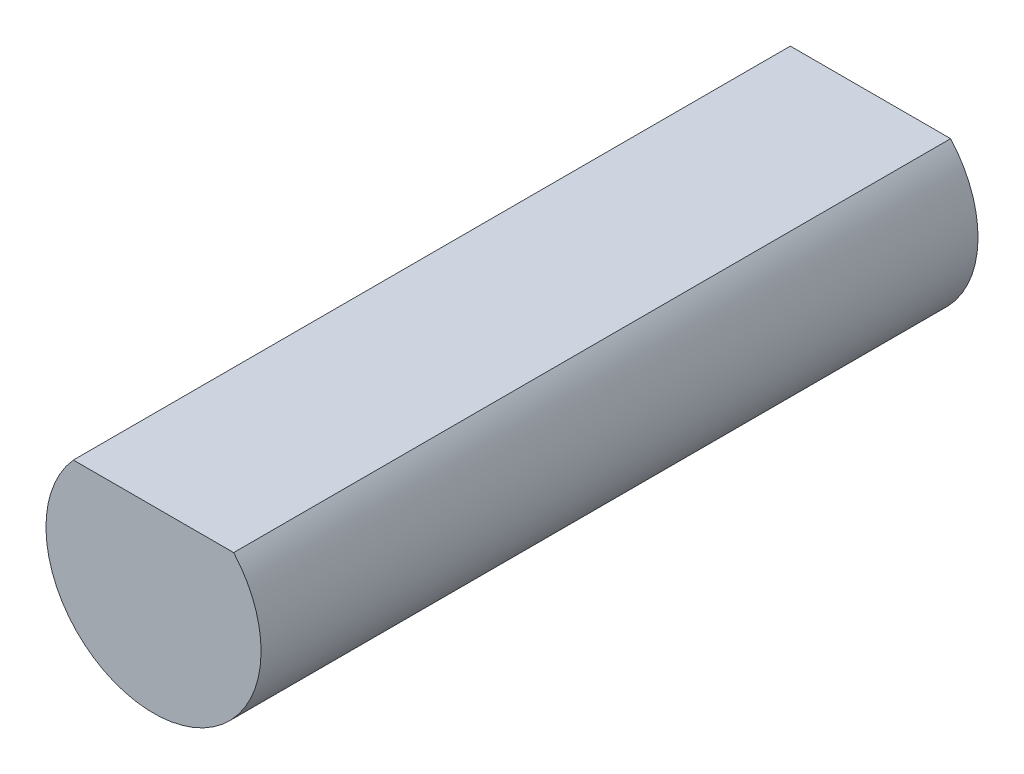
ISO-10303-21;
HEADER;
FILE_DESCRIPTION(('STEP AP214'),'2;1');
FILE_NAME('part.step','',(''),(''),'','','');
FILE_SCHEMA(('AUTOMOTIVE_DESIGN { 1 0 10303 214 1 1 1 1 }'));
ENDSEC;
DATA;
#1=APPLICATION_CONTEXT('core data for automotive mechanical design processes');
#2=APPLICATION_PROTOCOL_DEFINITION('international standard','automotive_design',2000,#1);
#3=PRODUCT_CONTEXT('',#1,'mechanical');
#4=PRODUCT('Part','Part','',(#3));
#5=PRODUCT_RELATED_PRODUCT_CATEGORY('part','',(#4));
#6=PRODUCT_DEFINITION_FORMATION('','',#4);
#7=PRODUCT_DEFINITION_CONTEXT('part definition',#1,'design');
#8=PRODUCT_DEFINITION('design','',#6,#7);
#9=PRODUCT_DEFINITION_SHAPE('','',#8);
#10=(LENGTH_UNIT() NAMED_UNIT(*) SI_UNIT(.MILLI.,.METRE.));
#11=(NAMED_UNIT(*) PLANE_ANGLE_UNIT() SI_UNIT($,.RADIAN.));
#12=(NAMED_UNIT(*) SI_UNIT($,.STERADIAN.) SOLID_ANGLE_UNIT());
#13=UNCERTAINTY_MEASURE_WITH_UNIT(LENGTH_MEASURE(1.E-05),#10,'distance_accuracy_value','');
#14=(GEOMETRIC_REPRESENTATION_CONTEXT(3) GLOBAL_UNCERTAINTY_ASSIGNED_CONTEXT((#13)) GLOBAL_UNIT_ASSIGNED_CONTEXT((#10,
#11,#12)) REPRESENTATION_CONTEXT('',''));
#15=CARTESIAN_POINT('',(0.,0.,0.));
#16=DIRECTION('',(0.,0.,1.));
#17=DIRECTION('',(1.,0.,0.));
#18=AXIS2_PLACEMENT_3D('',#15,#16,#17);
#19=CARTESIAN_POINT('',(0.,0.,10.));
#20=DIRECTION('',(0.,0.,-1.));
#21=DIRECTION('',(-1.,0.,0.));
#22=AXIS2_PLACEMENT_3D('',#19,#20,#21);
#23=CYLINDRICAL_SURFACE('',#22,1.5);
#24=CARTESIAN_POINT('',(0.,0.,10.));
#25=DIRECTION('',(0.,0.,1.));
#26=DIRECTION('',(1.,0.,0.));
#27=AXIS2_PLACEMENT_3D('',#24,#25,#26);
#28=CIRCLE('',#27,1.5);
#29=CARTESIAN_POINT('',(-1.1180339887499,1.,10.));
#30=VERTEX_POINT('',#29);
#31=CARTESIAN_POINT('',(1.1180339887499,1.,10.));
#32=VERTEX_POINT('',#31);
#33=EDGE_CURVE('E11',#30,#32,#28,.T.);
#34=ORIENTED_EDGE('',*,*,#33,.F.);
#35=DIRECTION('',(0.,0.,1.));
#36=VECTOR('',#35,1.);
#37=CARTESIAN_POINT('',(-1.1180339887499,1.,0.));
#38=LINE('',#37,#36);
#39=CARTESIAN_POINT('',(-1.1180339887499,1.,0.));
#40=VERTEX_POINT('',#39);
#41=EDGE_CURVE('E59',#40,#30,#38,.T.);
#42=ORIENTED_EDGE('',*,*,#41,.F.);
#43=CARTESIAN_POINT('',(0.,0.,0.));
#44=DIRECTION('',(0.,0.,1.));
#45=DIRECTION('',(1.,0.,0.));
#46=AXIS2_PLACEMENT_3D('',#43,#44,#45);
#47=CIRCLE('',#46,1.5);
#48=CARTESIAN_POINT('',(1.1180339887499,1.,0.));
#49=VERTEX_POINT('',#48);
#50=EDGE_CURVE('E39',#40,#49,#47,.T.);
#51=ORIENTED_EDGE('',*,*,#50,.T.);
#52=DIRECTION('',(0.,0.,1.));
#53=VECTOR('',#52,1.);
#54=CARTESIAN_POINT('',(1.1180339887499,1.,0.));
#55=LINE('',#54,#53);
#56=EDGE_CURVE('E50',#49,#32,#55,.T.);
#57=ORIENTED_EDGE('',*,*,#56,.T.);
#58=EDGE_LOOP('',(#34,#42,#51,#57));
#59=FACE_BOUND('',#58,.T.);
#60=ADVANCED_FACE('F36',(#59),#23,.T.);
#61=CARTESIAN_POINT('',(0.,0.,10.));
#62=DIRECTION('',(0.,0.,1.));
#63=DIRECTION('',(1.,0.,0.));
#64=AXIS2_PLACEMENT_3D('',#61,#62,#63);
#65=PLANE('',#64);
#66=DIRECTION('',(1.,0.,0.));
#67=VECTOR('',#66,1.);
#68=CARTESIAN_POINT('',(0.,1.,10.));
#69=LINE('',#68,#67);
#70=EDGE_CURVE('E62',#30,#32,#69,.T.);
#71=ORIENTED_EDGE('',*,*,#70,.F.);
#72=ORIENTED_EDGE('',*,*,#33,.T.);
#73=EDGE_LOOP('',(#71,#72));
#74=FACE_BOUND('',#73,.T.);
#75=ADVANCED_FACE('F69',(#74),#65,.T.);
#76=CARTESIAN_POINT('',(0.,0.,0.));
#77=DIRECTION('',(0.,0.,1.));
#78=DIRECTION('',(1.,0.,0.));
#79=AXIS2_PLACEMENT_3D('',#76,#77,#78);
#80=PLANE('',#79);
#81=ORIENTED_EDGE('',*,*,#50,.F.);
#82=DIRECTION('',(1.,0.,0.));
#83=VECTOR('',#82,1.);
#84=CARTESIAN_POINT('',(0.,1.,0.));
#85=LINE('',#84,#83);
#86=EDGE_CURVE('E55',#40,#49,#85,.T.);
#87=ORIENTED_EDGE('',*,*,#86,.T.);
#88=EDGE_LOOP('',(#81,#87));
#89=FACE_BOUND('',#88,.T.);
#90=ADVANCED_FACE('F74',(#89),#80,.F.);
#91=CARTESIAN_POINT('',(0.,1.,0.));
#92=DIRECTION('',(0.,-1.,0.));
#93=DIRECTION('',(1.,0.,0.));
#94=AXIS2_PLACEMENT_3D('',#91,#92,#93);
#95=PLANE('',#94);
#96=ORIENTED_EDGE('',*,*,#70,.T.);
#97=ORIENTED_EDGE('',*,*,#56,.F.);
#98=ORIENTED_EDGE('',*,*,#86,.F.);
#99=ORIENTED_EDGE('',*,*,#41,.T.);
#100=EDGE_LOOP('',(#96,#97,#98,#99));
#101=FACE_BOUND('',#100,.T.);
#102=ADVANCED_FACE('F61',(#101),#95,.F.);
#103=CLOSED_SHELL('',(#60,#75,#90,#102));
#104=MANIFOLD_SOLID_BREP('B2',#103);
#105=ADVANCED_BREP_SHAPE_REPRESENTATION('',(#18,#104),#14);
#106=SHAPE_DEFINITION_REPRESENTATION(#9,#105);
ENDSEC;
END-ISO-10303-21;
